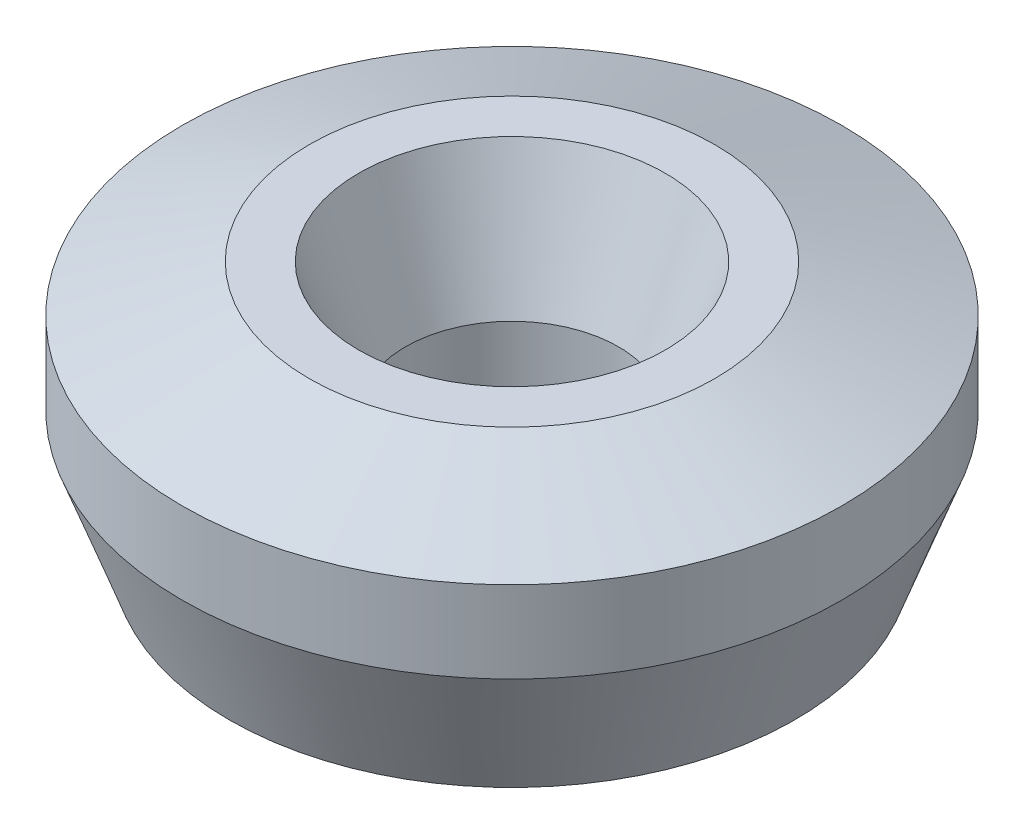
ISO-10303-21;
HEADER;
FILE_DESCRIPTION(('STEP AP214'),'2;1');
FILE_NAME('part.step','',(''),(''),'','','');
FILE_SCHEMA(('AUTOMOTIVE_DESIGN { 1 0 10303 214 1 1 1 1 }'));
ENDSEC;
DATA;
#1=APPLICATION_CONTEXT('core data for automotive mechanical design processes');
#2=APPLICATION_PROTOCOL_DEFINITION('international standard','automotive_design',2000,#1);
#3=PRODUCT_CONTEXT('',#1,'mechanical');
#4=PRODUCT('Part','Part','',(#3));
#5=PRODUCT_RELATED_PRODUCT_CATEGORY('part','',(#4));
#6=PRODUCT_DEFINITION_FORMATION('','',#4);
#7=PRODUCT_DEFINITION_CONTEXT('part definition',#1,'design');
#8=PRODUCT_DEFINITION('design','',#6,#7);
#9=PRODUCT_DEFINITION_SHAPE('','',#8);
#10=(LENGTH_UNIT() NAMED_UNIT(*) SI_UNIT(.MILLI.,.METRE.));
#11=(NAMED_UNIT(*) PLANE_ANGLE_UNIT() SI_UNIT($,.RADIAN.));
#12=(NAMED_UNIT(*) SI_UNIT($,.STERADIAN.) SOLID_ANGLE_UNIT());
#13=UNCERTAINTY_MEASURE_WITH_UNIT(LENGTH_MEASURE(1.E-05),#10,'distance_accuracy_value','');
#14=(GEOMETRIC_REPRESENTATION_CONTEXT(3) GLOBAL_UNCERTAINTY_ASSIGNED_CONTEXT((#13)) GLOBAL_UNIT_ASSIGNED_CONTEXT((#10,
#11,#12)) REPRESENTATION_CONTEXT('',''));
#15=CARTESIAN_POINT('',(0.,0.,0.));
#16=DIRECTION('',(0.,0.,1.));
#17=DIRECTION('',(1.,0.,0.));
#18=AXIS2_PLACEMENT_3D('',#15,#16,#17);
#19=CARTESIAN_POINT('',(0.,7.745418688873,0.));
#20=DIRECTION('',(0.,-1.,0.));
#21=DIRECTION('',(0.,0.,-1.));
#22=AXIS2_PLACEMENT_3D('',#19,#20,#21);
#23=CYLINDRICAL_SURFACE('',#22,10.);
#24=CARTESIAN_POINT('',(0.,3.85019091469643,0.));
#25=DIRECTION('',(0.,1.,0.));
#26=DIRECTION('',(0.,0.,1.));
#27=AXIS2_PLACEMENT_3D('',#24,#25,#26);
#28=CIRCLE('',#27,10.);
#29=CARTESIAN_POINT('',(0.,3.85019091469643,10.));
#30=VERTEX_POINT('',#29);
#31=EDGE_CURVE('E10',#30,#30,#28,.T.);
#32=ORIENTED_EDGE('',*,*,#31,.T.);
#33=EDGE_LOOP('',(#32));
#34=FACE_BOUND('',#33,.T.);
#35=CARTESIAN_POINT('',(0.,6.32704841269441,0.));
#36=DIRECTION('',(0.,1.,0.));
#37=DIRECTION('',(0.,0.,1.));
#38=AXIS2_PLACEMENT_3D('',#35,#36,#37);
#39=CIRCLE('',#38,10.);
#40=CARTESIAN_POINT('',(0.,6.32704841269441,10.));
#41=VERTEX_POINT('',#40);
#42=EDGE_CURVE('E50',#41,#41,#39,.F.);
#43=ORIENTED_EDGE('',*,*,#42,.T.);
#44=EDGE_LOOP('',(#43));
#45=FACE_BOUND('',#44,.T.);
#46=ADVANCED_FACE('F39',(#34,#45),#23,.T.);
#47=CARTESIAN_POINT('',(0.,7.745418688873,0.));
#48=DIRECTION('',(0.,1.,0.));
#49=DIRECTION('',(0.,0.,1.));
#50=AXIS2_PLACEMENT_3D('',#47,#48,#49);
#51=PLANE('',#50);
#52=CARTESIAN_POINT('',(0.,7.745418688873,0.));
#53=DIRECTION('',(0.,1.,0.));
#54=DIRECTION('',(0.,0.,1.));
#55=AXIS2_PLACEMENT_3D('',#52,#53,#54);
#56=CIRCLE('',#55,4.64865685720222);
#57=CARTESIAN_POINT('',(0.,7.745418688873,4.64865685720222));
#58=VERTEX_POINT('',#57);
#59=EDGE_CURVE('E58',#58,#58,#56,.F.);
#60=ORIENTED_EDGE('',*,*,#59,.T.);
#61=EDGE_LOOP('',(#60));
#62=FACE_BOUND('',#61,.T.);
#63=CARTESIAN_POINT('',(0.,7.745418688873,0.));
#64=DIRECTION('',(0.,1.,0.));
#65=DIRECTION('',(0.,0.,1.));
#66=AXIS2_PLACEMENT_3D('',#63,#64,#65);
#67=CIRCLE('',#66,6.14980908530359);
#68=CARTESIAN_POINT('',(0.,7.745418688873,6.14980908530359));
#69=VERTEX_POINT('',#68);
#70=EDGE_CURVE('E61',#69,#69,#67,.T.);
#71=ORIENTED_EDGE('',*,*,#70,.T.);
#72=EDGE_LOOP('',(#71));
#73=FACE_BOUND('',#72,.T.);
#74=ADVANCED_FACE('F88',(#62,#73),#51,.T.);
#75=CARTESIAN_POINT('',(0.,0.,0.));
#76=DIRECTION('',(0.,1.,0.));
#77=DIRECTION('',(0.,0.,1.));
#78=AXIS2_PLACEMENT_3D('',#75,#76,#77);
#79=PLANE('',#78);
#80=CARTESIAN_POINT('',(0.,0.,0.));
#81=DIRECTION('',(0.,1.,0.));
#82=DIRECTION('',(0.,0.,1.));
#83=AXIS2_PLACEMENT_3D('',#80,#81,#82);
#84=CIRCLE('',#83,7.08047749572004);
#85=CARTESIAN_POINT('',(0.,0.,7.08047749572004));
#86=VERTEX_POINT('',#85);
#87=EDGE_CURVE('E51',#86,#86,#84,.T.);
#88=ORIENTED_EDGE('',*,*,#87,.T.);
#89=EDGE_LOOP('',(#88));
#90=FACE_BOUND('',#89,.T.);
#91=CARTESIAN_POINT('',(0.,0.,0.));
#92=DIRECTION('',(0.,1.,0.));
#93=DIRECTION('',(0.,0.,1.));
#94=AXIS2_PLACEMENT_3D('',#91,#92,#93);
#95=CIRCLE('',#94,8.5816297238214);
#96=CARTESIAN_POINT('',(0.,0.,8.5816297238214));
#97=VERTEX_POINT('',#96);
#98=EDGE_CURVE('E54',#97,#97,#95,.F.);
#99=ORIENTED_EDGE('',*,*,#98,.T.);
#100=EDGE_LOOP('',(#99));
#101=FACE_BOUND('',#100,.T.);
#102=ADVANCED_FACE('F83',(#90,#101),#79,.F.);
#103=CARTESIAN_POINT('',(0.,7.745418688873,0.));
#104=DIRECTION('',(0.,-1.,0.));
#105=DIRECTION('',(0.,0.,-1.));
#106=AXIS2_PLACEMENT_3D('',#103,#104,#105);
#107=CYLINDRICAL_SURFACE('',#106,3.23028658102362);
#108=CARTESIAN_POINT('',(0.,3.89522777417659,0.));
#109=DIRECTION('',(0.,1.,0.));
#110=DIRECTION('',(0.,0.,1.));
#111=AXIS2_PLACEMENT_3D('',#108,#109,#110);
#112=CIRCLE('',#111,3.23028658102362);
#113=CARTESIAN_POINT('',(0.,3.89522777417659,3.23028658102362));
#114=VERTEX_POINT('',#113);
#115=EDGE_CURVE('E67',#114,#114,#112,.T.);
#116=ORIENTED_EDGE('',*,*,#115,.T.);
#117=EDGE_LOOP('',(#116));
#118=FACE_BOUND('',#117,.T.);
#119=CARTESIAN_POINT('',(0.,1.4183702761786,0.));
#120=DIRECTION('',(0.,1.,0.));
#121=DIRECTION('',(0.,0.,1.));
#122=AXIS2_PLACEMENT_3D('',#119,#120,#121);
#123=CIRCLE('',#122,3.23028658102362);
#124=CARTESIAN_POINT('',(0.,1.4183702761786,3.23028658102362));
#125=VERTEX_POINT('',#124);
#126=EDGE_CURVE('E69',#125,#125,#123,.F.);
#127=ORIENTED_EDGE('',*,*,#126,.T.);
#128=EDGE_LOOP('',(#127));
#129=FACE_BOUND('',#128,.T.);
#130=ADVANCED_FACE('F71',(#118,#129),#107,.F.);
#131=CARTESIAN_POINT('',(0.,3.89522777417659,0.));
#132=DIRECTION('',(0.,1.,0.));
#133=DIRECTION('',(0.,0.,1.));
#134=AXIS2_PLACEMENT_3D('',#131,#132,#133);
#135=CONICAL_SURFACE('',#134,3.23028658102362,0.352962690498891);
#136=CARTESIAN_POINT('',(0.,7.745418688873,4.64865685720222));
#137=CARTESIAN_POINT('',(0.,7.70531253351158,4.63388216682536));
#138=CARTESIAN_POINT('',(0.,7.66520637815016,4.6191074764485));
#139=CARTESIAN_POINT('',(0.,7.58499406742732,4.58955809569478));
#140=CARTESIAN_POINT('',(0.,7.5448879120659,4.57478340531791));
#141=CARTESIAN_POINT('',(0.,7.46467560134306,4.54523402456419));
#142=CARTESIAN_POINT('',(0.,7.42456944598164,4.53045933418733));
#143=CARTESIAN_POINT('',(0.,7.34435713525879,4.50090995343361));
#144=CARTESIAN_POINT('',(0.,7.30425097989737,4.48613526305675));
#145=CARTESIAN_POINT('',(0.,7.22403866917453,4.45658588230303));
#146=CARTESIAN_POINT('',(0.,7.18393251381311,4.44181119192617));
#147=CARTESIAN_POINT('',(0.,7.10372020309027,4.41226181117245));
#148=CARTESIAN_POINT('',(0.,7.06361404772885,4.39748712079559));
#149=CARTESIAN_POINT('',(0.,6.98340173700601,4.36793774004187));
#150=CARTESIAN_POINT('',(0.,6.94329558164458,4.35316304966501));
#151=CARTESIAN_POINT('',(0.,6.86308327092174,4.32361366891129));
#152=CARTESIAN_POINT('',(0.,6.82297711556032,4.30883897853443));
#153=CARTESIAN_POINT('',(0.,6.74276480483748,4.27928959778071));
#154=CARTESIAN_POINT('',(0.,6.70265864947606,4.26451490740385));
#155=CARTESIAN_POINT('',(0.,6.62244633875322,4.23496552665013));
#156=CARTESIAN_POINT('',(0.,6.5823401833918,4.22019083627326));
#157=CARTESIAN_POINT('',(0.,6.50212787266895,4.19064145551954));
#158=CARTESIAN_POINT('',(0.,6.46202171730753,4.17586676514268));
#159=CARTESIAN_POINT('',(0.,6.38180940658469,4.14631738438896));
#160=CARTESIAN_POINT('',(0.,6.34170325122327,4.1315426940121));
#161=CARTESIAN_POINT('',(0.,6.26149094050043,4.10199331325838));
#162=CARTESIAN_POINT('',(0.,6.22138478513901,4.08721862288152));
#163=CARTESIAN_POINT('',(0.,6.14117247441616,4.0576692421278));
#164=CARTESIAN_POINT('',(0.,6.10106631905474,4.04289455175094));
#165=CARTESIAN_POINT('',(0.,6.0208540083319,4.01334517099722));
#166=CARTESIAN_POINT('',(0.,5.98074785297048,3.99857048062036));
#167=CARTESIAN_POINT('',(0.,5.90053554224764,3.96902109986664));
#168=CARTESIAN_POINT('',(0.,5.86042938688622,3.95424640948978));
#169=CARTESIAN_POINT('',(0.,5.78021707616338,3.92469702873606));
#170=CARTESIAN_POINT('',(0.,5.74011092080195,3.9099223383592));
#171=CARTESIAN_POINT('',(0.,5.65989861007911,3.88037295760547));
#172=CARTESIAN_POINT('',(0.,5.61979245471769,3.86559826722861));
#173=CARTESIAN_POINT('',(0.,5.53958014399485,3.83604888647489));
#174=CARTESIAN_POINT('',(0.,5.49947398863343,3.82127419609803));
#175=CARTESIAN_POINT('',(0.,5.41926167791059,3.79172481534431));
#176=CARTESIAN_POINT('',(0.,5.37915552254917,3.77695012496745));
#177=CARTESIAN_POINT('',(0.,5.29894321182632,3.74740074421373));
#178=CARTESIAN_POINT('',(0.,5.2588370564649,3.73262605383687));
#179=CARTESIAN_POINT('',(0.,5.17862474574206,3.70307667308315));
#180=CARTESIAN_POINT('',(0.,5.13851859038064,3.68830198270629));
#181=CARTESIAN_POINT('',(0.,5.0583062796578,3.65875260195257));
#182=CARTESIAN_POINT('',(0.,5.01820012429638,3.64397791157571));
#183=CARTESIAN_POINT('',(0.,4.93798781357353,3.61442853082199));
#184=CARTESIAN_POINT('',(0.,4.89788165821211,3.59965384044513));
#185=CARTESIAN_POINT('',(0.,4.81766934748927,3.57010445969141));
#186=CARTESIAN_POINT('',(0.,4.77756319212785,3.55532976931455));
#187=CARTESIAN_POINT('',(0.,4.69735088140501,3.52578038856082));
#188=CARTESIAN_POINT('',(0.,4.65724472604359,3.51100569818396));
#189=CARTESIAN_POINT('',(0.,4.57703241532075,3.48145631743024));
#190=CARTESIAN_POINT('',(0.,4.53692625995933,3.46668162705338));
#191=CARTESIAN_POINT('',(0.,4.45671394923648,3.43713224629966));
#192=CARTESIAN_POINT('',(0.,4.41660779387506,3.4223575559228));
#193=CARTESIAN_POINT('',(0.,4.33639548315222,3.39280817516908));
#194=CARTESIAN_POINT('',(0.,4.2962893277908,3.37803348479222));
#195=CARTESIAN_POINT('',(0.,4.21607701706796,3.3484841040385));
#196=CARTESIAN_POINT('',(0.,4.17597086170653,3.33370941366164));
#197=CARTESIAN_POINT('',(0.,4.09575855098369,3.30416003290792));
#198=CARTESIAN_POINT('',(0.,4.05565239562227,3.28938534253106));
#199=CARTESIAN_POINT('',(0.,3.97544008489943,3.25983596177734));
#200=CARTESIAN_POINT('',(0.,3.93533392953801,3.24506127140048));
#201=CARTESIAN_POINT('',(0.,3.89522777417659,3.23028658102362));
#202=B_SPLINE_CURVE_WITH_KNOTS('',3,(#136,#137,#138,#139,#140,#141,#142,#143,#144,#145,#146,
#147,#148,#149,#150,#151,#152,#153,#154,#155,#156,#157,#158,#159,#160,#161,#162,#163,#164,#165,
#166,#167,#168,#169,#170,#171,#172,#173,#174,#175,#176,#177,#178,#179,#180,#181,#182,#183,#184,
#185,#186,#187,#188,#189,#190,#191,#192,#193,#194,#195,#196,#197,#198,#199,#200,#201),
.UNSPECIFIED.,.F.,.F.,(4,2,2,2,2,2,2,2,2,2,2,2,2,2,2,2,2,2,2,2,2,2,2,2,2,2,2,2,2,2,2,2,4),(0.,
0.12822307344023,0.256446146880461,0.384669220320691,0.512892293760922,0.641115367201153,
0.769338440641383,0.897561514081613,1.02578458752184,1.15400766096208,1.28223073440231,
1.41045380784254,1.53867688128277,1.666899954723,1.79512302816323,1.92334610160346,
2.05156917504369,2.17979224848392,2.30801532192415,2.43623839536438,2.56446146880461,
2.69268454224484,2.82090761568507,2.9491306891253,3.07735376256553,3.20557683600576,
3.33379990944599,3.46202298288623,3.59024605632646,3.71846912976669,3.84669220320692,
3.97491527664715,4.10313835008738),.UNSPECIFIED.);
#203=EDGE_CURVE('BSEAM77',#58,#114,#202,.T.);
#204=ORIENTED_EDGE('',*,*,#59,.F.);
#205=ORIENTED_EDGE('',*,*,#115,.F.);
#206=ORIENTED_EDGE('',*,*,#203,.T.);
#207=ORIENTED_EDGE('',*,*,#203,.F.);
#208=EDGE_LOOP('',(#204,#206,#205,#207));
#209=FACE_BOUND('',#208,.T.);
#210=ADVANCED_FACE('F77',(#209),#135,.F.);
#211=CARTESIAN_POINT('',(0.,0.,0.));
#212=DIRECTION('',(0.,-1.,0.));
#213=DIRECTION('',(0.,0.,-1.));
#214=AXIS2_PLACEMENT_3D('',#211,#212,#213);
#215=CONICAL_SURFACE('',#214,7.08047749572004,1.21783363629601);
#216=ORIENTED_EDGE('',*,*,#126,.F.);
#217=EDGE_LOOP('',(#216));
#218=FACE_BOUND('',#217,.T.);
#219=ORIENTED_EDGE('',*,*,#87,.F.);
#220=EDGE_LOOP('',(#219));
#221=FACE_BOUND('',#220,.T.);
#222=ADVANCED_FACE('F73',(#218,#221),#215,.F.);
#223=CARTESIAN_POINT('',(0.,3.85019091469643,0.));
#224=DIRECTION('',(0.,1.,0.));
#225=DIRECTION('',(0.,0.,1.));
#226=AXIS2_PLACEMENT_3D('',#223,#224,#225);
#227=CONICAL_SURFACE('',#226,10.,0.35296269049889);
#228=ORIENTED_EDGE('',*,*,#98,.F.);
#229=EDGE_LOOP('',(#228));
#230=FACE_BOUND('',#229,.T.);
#231=ORIENTED_EDGE('',*,*,#31,.F.);
#232=EDGE_LOOP('',(#231));
#233=FACE_BOUND('',#232,.T.);
#234=ADVANCED_FACE('F76',(#230,#233),#227,.T.);
#235=CARTESIAN_POINT('',(0.,7.745418688873,0.));
#236=DIRECTION('',(0.,-1.,0.));
#237=DIRECTION('',(0.,0.,-1.));
#238=AXIS2_PLACEMENT_3D('',#235,#236,#237);
#239=CONICAL_SURFACE('',#238,6.14980908530359,1.21783363629601);
#240=ORIENTED_EDGE('',*,*,#42,.F.);
#241=EDGE_LOOP('',(#240));
#242=FACE_BOUND('',#241,.T.);
#243=ORIENTED_EDGE('',*,*,#70,.F.);
#244=EDGE_LOOP('',(#243));
#245=FACE_BOUND('',#244,.T.);
#246=ADVANCED_FACE('F45',(#242,#245),#239,.T.);
#247=CLOSED_SHELL('',(#46,#74,#102,#130,#210,#222,#234,#246));
#248=MANIFOLD_SOLID_BREP('B2',#247);
#249=ADVANCED_BREP_SHAPE_REPRESENTATION('',(#18,#248),#14);
#250=SHAPE_DEFINITION_REPRESENTATION(#9,#249);
ENDSEC;
END-ISO-10303-21;
